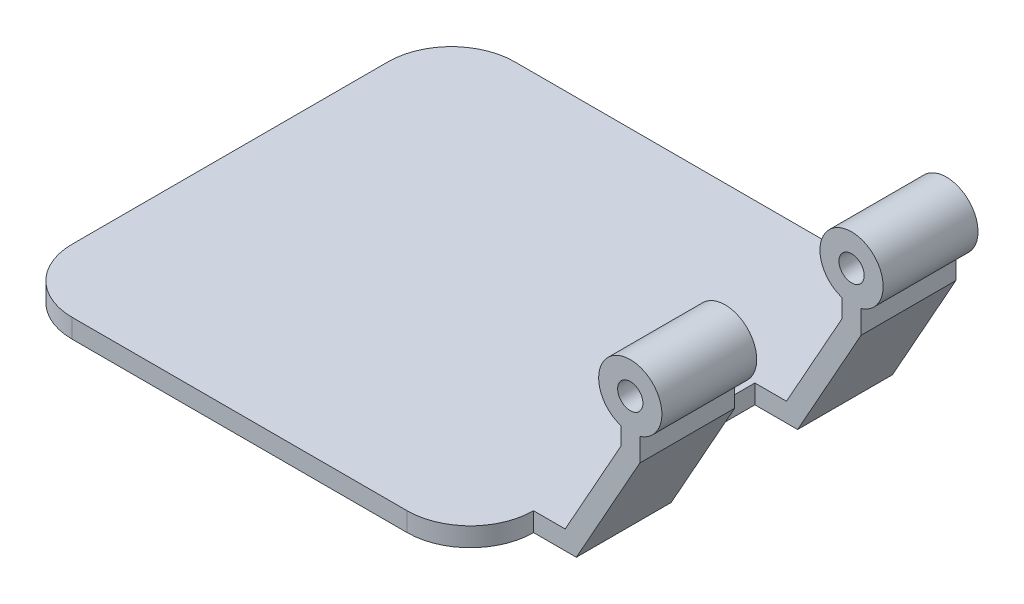
ISO-10303-21;
HEADER;
FILE_DESCRIPTION(('STEP AP214'),'2;1');
FILE_NAME('part.step','',(''),(''),'','','');
FILE_SCHEMA(('AUTOMOTIVE_DESIGN { 1 0 10303 214 1 1 1 1 }'));
ENDSEC;
DATA;
#1=APPLICATION_CONTEXT('core data for automotive mechanical design processes');
#2=APPLICATION_PROTOCOL_DEFINITION('international standard','automotive_design',2000,#1);
#3=PRODUCT_CONTEXT('',#1,'mechanical');
#4=PRODUCT('Part','Part','',(#3));
#5=PRODUCT_RELATED_PRODUCT_CATEGORY('part','',(#4));
#6=PRODUCT_DEFINITION_FORMATION('','',#4);
#7=PRODUCT_DEFINITION_CONTEXT('part definition',#1,'design');
#8=PRODUCT_DEFINITION('design','',#6,#7);
#9=PRODUCT_DEFINITION_SHAPE('','',#8);
#10=(LENGTH_UNIT() NAMED_UNIT(*) SI_UNIT(.MILLI.,.METRE.));
#11=(NAMED_UNIT(*) PLANE_ANGLE_UNIT() SI_UNIT($,.RADIAN.));
#12=(NAMED_UNIT(*) SI_UNIT($,.STERADIAN.) SOLID_ANGLE_UNIT());
#13=UNCERTAINTY_MEASURE_WITH_UNIT(LENGTH_MEASURE(1.E-05),#10,'distance_accuracy_value','');
#14=(GEOMETRIC_REPRESENTATION_CONTEXT(3) GLOBAL_UNCERTAINTY_ASSIGNED_CONTEXT((#13)) GLOBAL_UNIT_ASSIGNED_CONTEXT((#10,
#11,#12)) REPRESENTATION_CONTEXT('',''));
#15=CARTESIAN_POINT('',(0.,0.,0.));
#16=DIRECTION('',(0.,0.,1.));
#17=DIRECTION('',(1.,0.,0.));
#18=AXIS2_PLACEMENT_3D('',#15,#16,#17);
#19=CARTESIAN_POINT('',(90.2917408136151,26.3526404117387,50.));
#20=DIRECTION('',(0.,0.,-1.));
#21=DIRECTION('',(-1.,0.,0.));
#22=AXIS2_PLACEMENT_3D('',#19,#20,#21);
#23=CYLINDRICAL_SURFACE('',#22,5.);
#24=CARTESIAN_POINT('',(90.2917408136151,26.3526404117387,15.));
#25=DIRECTION('',(0.,0.,1.));
#26=DIRECTION('',(0.,-1.,0.));
#27=AXIS2_PLACEMENT_3D('',#24,#25,#26);
#28=CIRCLE('',#27,5.);
#29=CARTESIAN_POINT('',(91.7917408136151,21.582944404654,15.));
#30=VERTEX_POINT('',#29);
#31=CARTESIAN_POINT('',(88.7917408136151,21.582944404654,15.));
#32=VERTEX_POINT('',#31);
#33=EDGE_CURVE('E268',#30,#32,#28,.T.);
#34=ORIENTED_EDGE('',*,*,#33,.F.);
#35=DIRECTION('',(0.,0.,-1.));
#36=VECTOR('',#35,1.);
#37=CARTESIAN_POINT('',(91.7917408136151,21.582944404654,50.));
#38=LINE('',#37,#36);
#39=CARTESIAN_POINT('',(91.7917408136151,21.582944404654,0.));
#40=VERTEX_POINT('',#39);
#41=EDGE_CURVE('E355',#30,#40,#38,.T.);
#42=ORIENTED_EDGE('',*,*,#41,.T.);
#43=CARTESIAN_POINT('',(90.2917408136151,26.3526404117387,0.));
#44=DIRECTION('',(0.,0.,1.));
#45=DIRECTION('',(1.,0.,0.));
#46=AXIS2_PLACEMENT_3D('',#43,#44,#45);
#47=CIRCLE('',#46,5.);
#48=CARTESIAN_POINT('',(88.7917408136151,21.582944404654,0.));
#49=VERTEX_POINT('',#48);
#50=EDGE_CURVE('E296',#40,#49,#47,.T.);
#51=ORIENTED_EDGE('',*,*,#50,.T.);
#52=DIRECTION('',(0.,0.,-1.));
#53=VECTOR('',#52,1.);
#54=CARTESIAN_POINT('',(88.7917408136151,21.582944404654,50.));
#55=LINE('',#54,#53);
#56=EDGE_CURVE('E347',#32,#49,#55,.T.);
#57=ORIENTED_EDGE('',*,*,#56,.F.);
#58=EDGE_LOOP('',(#34,#42,#51,#57));
#59=FACE_BOUND('',#58,.T.);
#60=ADVANCED_FACE('F62',(#59),#23,.T.);
#61=CARTESIAN_POINT('',(90.2917408136151,26.3526404117387,35.));
#62=DIRECTION('',(0.,0.,-1.));
#63=DIRECTION('',(0.,1.,0.));
#64=AXIS2_PLACEMENT_3D('',#61,#62,#63);
#65=CIRCLE('',#64,5.);
#66=CARTESIAN_POINT('',(88.7917408136151,21.582944404654,35.));
#67=VERTEX_POINT('',#66);
#68=CARTESIAN_POINT('',(91.7917408136151,21.582944404654,35.));
#69=VERTEX_POINT('',#68);
#70=EDGE_CURVE('E282',#67,#69,#65,.T.);
#71=ORIENTED_EDGE('',*,*,#70,.F.);
#72=CARTESIAN_POINT('',(88.7917408136151,21.582944404654,50.));
#73=VERTEX_POINT('',#72);
#74=EDGE_CURVE('E352',#73,#67,#55,.T.);
#75=ORIENTED_EDGE('',*,*,#74,.F.);
#76=CARTESIAN_POINT('',(90.2917408136151,26.3526404117387,50.));
#77=DIRECTION('',(0.,0.,1.));
#78=DIRECTION('',(1.,0.,0.));
#79=AXIS2_PLACEMENT_3D('',#76,#77,#78);
#80=CIRCLE('',#79,5.);
#81=CARTESIAN_POINT('',(91.7917408136151,21.582944404654,50.));
#82=VERTEX_POINT('',#81);
#83=EDGE_CURVE('E319',#82,#73,#80,.T.);
#84=ORIENTED_EDGE('',*,*,#83,.F.);
#85=EDGE_CURVE('E356',#82,#69,#38,.T.);
#86=ORIENTED_EDGE('',*,*,#85,.T.);
#87=EDGE_LOOP('',(#71,#75,#84,#86));
#88=FACE_BOUND('',#87,.T.);
#89=ADVANCED_FACE('F463',(#88),#23,.T.);
#90=CARTESIAN_POINT('',(110.015744072677,30.0086373562634,35.));
#91=DIRECTION('',(0.,0.,-1.));
#92=DIRECTION('',(0.,1.,0.));
#93=AXIS2_PLACEMENT_3D('',#90,#91,#92);
#94=PLANE('',#93);
#95=DIRECTION('',(-0.488430045200838,-0.872603054627422,0.));
#96=VECTOR('',#95,1.);
#97=CARTESIAN_POINT('',(81.7587720513456,0.,35.));
#98=LINE('',#97,#96);
#99=CARTESIAN_POINT('',(91.7917408136151,17.9243666006214,35.));
#100=VERTEX_POINT('',#99);
#101=CARTESIAN_POINT('',(81.7587720513456,0.,35.));
#102=VERTEX_POINT('',#101);
#103=EDGE_CURVE('E231',#100,#102,#98,.T.);
#104=ORIENTED_EDGE('',*,*,#103,.T.);
#105=DIRECTION('',(1.,0.,0.));
#106=VECTOR('',#105,1.);
#107=CARTESIAN_POINT('',(75.,0.,35.));
#108=LINE('',#107,#106);
#109=CARTESIAN_POINT('',(75.,0.,35.));
#110=VERTEX_POINT('',#109);
#111=EDGE_CURVE('E227',#110,#102,#108,.T.);
#112=ORIENTED_EDGE('',*,*,#111,.F.);
#113=DIRECTION('',(0.,1.,0.));
#114=VECTOR('',#113,1.);
#115=CARTESIAN_POINT('',(75.,0.,35.));
#116=LINE('',#115,#114);
#117=CARTESIAN_POINT('',(75.,3.,35.));
#118=VERTEX_POINT('',#117);
#119=EDGE_CURVE('E212',#110,#118,#116,.T.);
#120=ORIENTED_EDGE('',*,*,#119,.T.);
#121=DIRECTION('',(1.,0.,0.));
#122=VECTOR('',#121,1.);
#123=CARTESIAN_POINT('',(75.,3.,35.));
#124=LINE('',#123,#122);
#125=CARTESIAN_POINT('',(80.,3.,35.));
#126=VERTEX_POINT('',#125);
#127=EDGE_CURVE('E240',#118,#126,#124,.T.);
#128=ORIENTED_EDGE('',*,*,#127,.T.);
#129=DIRECTION('',(0.488430045200838,0.872603054627422,0.));
#130=VECTOR('',#129,1.);
#131=CARTESIAN_POINT('',(88.7917408136151,18.7068549832936,35.));
#132=LINE('',#131,#130);
#133=CARTESIAN_POINT('',(88.7917408136151,18.7068549832936,35.));
#134=VERTEX_POINT('',#133);
#135=EDGE_CURVE('E285',#126,#134,#132,.T.);
#136=ORIENTED_EDGE('',*,*,#135,.T.);
#137=DIRECTION('',(0.,-1.,0.));
#138=VECTOR('',#137,1.);
#139=CARTESIAN_POINT('',(88.7917408136151,18.7068549832936,35.));
#140=LINE('',#139,#138);
#141=EDGE_CURVE('E286',#67,#134,#140,.T.);
#142=ORIENTED_EDGE('',*,*,#141,.F.);
#143=ORIENTED_EDGE('',*,*,#70,.T.);
#144=DIRECTION('',(0.,-1.,0.));
#145=VECTOR('',#144,1.);
#146=CARTESIAN_POINT('',(91.7917408136151,17.9243666006214,35.));
#147=LINE('',#146,#145);
#148=EDGE_CURVE('E284',#69,#100,#147,.T.);
#149=ORIENTED_EDGE('',*,*,#148,.T.);
#150=EDGE_LOOP('',(#104,#112,#120,#128,#136,#142,#143,#149));
#151=FACE_BOUND('',#150,.T.);
#152=CARTESIAN_POINT('',(90.2917408136151,26.3526404117387,35.));
#153=DIRECTION('',(0.,0.,-1.));
#154=DIRECTION('',(0.,1.,0.));
#155=AXIS2_PLACEMENT_3D('',#152,#153,#154);
#156=CIRCLE('',#155,2.);
#157=CARTESIAN_POINT('',(90.2917408136151,28.3526404117387,35.));
#158=VERTEX_POINT('',#157);
#159=EDGE_CURVE('E281',#158,#158,#156,.T.);
#160=ORIENTED_EDGE('',*,*,#159,.F.);
#161=EDGE_LOOP('',(#160));
#162=FACE_BOUND('',#161,.T.);
#163=ADVANCED_FACE('F228',(#151,#162),#94,.T.);
#164=CARTESIAN_POINT('',(110.015744072677,30.0086373562634,15.));
#165=DIRECTION('',(0.,0.,1.));
#166=DIRECTION('',(0.,-1.,0.));
#167=AXIS2_PLACEMENT_3D('',#164,#165,#166);
#168=PLANE('',#167);
#169=DIRECTION('',(-1.,0.,0.));
#170=VECTOR('',#169,1.);
#171=CARTESIAN_POINT('',(75.,0.,15.));
#172=LINE('',#171,#170);
#173=CARTESIAN_POINT('',(81.7587720513456,0.,15.));
#174=VERTEX_POINT('',#173);
#175=CARTESIAN_POINT('',(75.,0.,15.));
#176=VERTEX_POINT('',#175);
#177=EDGE_CURVE('E224',#174,#176,#172,.T.);
#178=ORIENTED_EDGE('',*,*,#177,.F.);
#179=DIRECTION('',(0.488430045200838,0.872603054627422,0.));
#180=VECTOR('',#179,1.);
#181=CARTESIAN_POINT('',(81.7587720513456,0.,15.));
#182=LINE('',#181,#180);
#183=CARTESIAN_POINT('',(91.7917408136151,17.9243666006214,15.));
#184=VERTEX_POINT('',#183);
#185=EDGE_CURVE('E271',#174,#184,#182,.T.);
#186=ORIENTED_EDGE('',*,*,#185,.T.);
#187=DIRECTION('',(0.,1.,0.));
#188=VECTOR('',#187,1.);
#189=CARTESIAN_POINT('',(91.7917408136151,17.9243666006214,15.));
#190=LINE('',#189,#188);
#191=EDGE_CURVE('E272',#184,#30,#190,.T.);
#192=ORIENTED_EDGE('',*,*,#191,.T.);
#193=ORIENTED_EDGE('',*,*,#33,.T.);
#194=DIRECTION('',(0.,1.,0.));
#195=VECTOR('',#194,1.);
#196=CARTESIAN_POINT('',(88.7917408136151,18.7068549832936,15.));
#197=LINE('',#196,#195);
#198=CARTESIAN_POINT('',(88.7917408136151,18.7068549832936,15.));
#199=VERTEX_POINT('',#198);
#200=EDGE_CURVE('E270',#199,#32,#197,.T.);
#201=ORIENTED_EDGE('',*,*,#200,.F.);
#202=DIRECTION('',(-0.488430045200838,-0.872603054627422,0.));
#203=VECTOR('',#202,1.);
#204=CARTESIAN_POINT('',(88.7917408136151,18.7068549832936,15.));
#205=LINE('',#204,#203);
#206=CARTESIAN_POINT('',(80.,3.,15.));
#207=VERTEX_POINT('',#206);
#208=EDGE_CURVE('E278',#199,#207,#205,.T.);
#209=ORIENTED_EDGE('',*,*,#208,.T.);
#210=DIRECTION('',(-1.,0.,0.));
#211=VECTOR('',#210,1.);
#212=CARTESIAN_POINT('',(75.,3.,15.));
#213=LINE('',#212,#211);
#214=CARTESIAN_POINT('',(75.,3.,15.));
#215=VERTEX_POINT('',#214);
#216=EDGE_CURVE('E238',#207,#215,#213,.T.);
#217=ORIENTED_EDGE('',*,*,#216,.T.);
#218=DIRECTION('',(0.,1.,0.));
#219=VECTOR('',#218,1.);
#220=CARTESIAN_POINT('',(75.,0.,15.));
#221=LINE('',#220,#219);
#222=EDGE_CURVE('E223',#176,#215,#221,.T.);
#223=ORIENTED_EDGE('',*,*,#222,.F.);
#224=EDGE_LOOP('',(#178,#186,#192,#193,#201,#209,#217,#223));
#225=FACE_BOUND('',#224,.T.);
#226=CARTESIAN_POINT('',(90.2917408136151,26.3526404117387,15.));
#227=DIRECTION('',(0.,0.,1.));
#228=DIRECTION('',(0.,-1.,0.));
#229=AXIS2_PLACEMENT_3D('',#226,#227,#228);
#230=CIRCLE('',#229,2.);
#231=CARTESIAN_POINT('',(90.2917408136151,24.3526404117387,15.));
#232=VERTEX_POINT('',#231);
#233=EDGE_CURVE('E267',#232,#232,#230,.T.);
#234=ORIENTED_EDGE('',*,*,#233,.F.);
#235=EDGE_LOOP('',(#234));
#236=FACE_BOUND('',#235,.T.);
#237=ADVANCED_FACE('F431',(#225,#236),#168,.T.);
#238=CARTESIAN_POINT('',(88.7917408136151,18.7068549832936,50.));
#239=DIRECTION('',(-1.,0.,0.));
#240=DIRECTION('',(0.,0.,1.));
#241=AXIS2_PLACEMENT_3D('',#238,#239,#240);
#242=PLANE('',#241);
#243=ORIENTED_EDGE('',*,*,#74,.T.);
#244=ORIENTED_EDGE('',*,*,#141,.T.);
#245=DIRECTION('',(0.,0.,-1.));
#246=VECTOR('',#245,1.);
#247=CARTESIAN_POINT('',(88.7917408136151,18.7068549832936,50.));
#248=LINE('',#247,#246);
#249=CARTESIAN_POINT('',(88.7917408136151,18.7068549832936,50.));
#250=VERTEX_POINT('',#249);
#251=EDGE_CURVE('E337',#250,#134,#248,.T.);
#252=ORIENTED_EDGE('',*,*,#251,.F.);
#253=DIRECTION('',(0.,1.,0.));
#254=VECTOR('',#253,1.);
#255=CARTESIAN_POINT('',(88.7917408136151,18.7068549832936,50.));
#256=LINE('',#255,#254);
#257=EDGE_CURVE('E307',#250,#73,#256,.T.);
#258=ORIENTED_EDGE('',*,*,#257,.T.);
#259=EDGE_LOOP('',(#243,#244,#252,#258));
#260=FACE_BOUND('',#259,.T.);
#261=ADVANCED_FACE('F455',(#260),#242,.T.);
#262=CARTESIAN_POINT('',(88.7917408136151,18.7068549832936,0.));
#263=VERTEX_POINT('',#262);
#264=EDGE_CURVE('E336',#199,#263,#248,.T.);
#265=ORIENTED_EDGE('',*,*,#264,.F.);
#266=ORIENTED_EDGE('',*,*,#200,.T.);
#267=ORIENTED_EDGE('',*,*,#56,.T.);
#268=DIRECTION('',(0.,1.,0.));
#269=VECTOR('',#268,1.);
#270=CARTESIAN_POINT('',(88.7917408136151,18.7068549832936,0.));
#271=LINE('',#270,#269);
#272=EDGE_CURVE('E325',#263,#49,#271,.T.);
#273=ORIENTED_EDGE('',*,*,#272,.F.);
#274=EDGE_LOOP('',(#265,#266,#267,#273));
#275=FACE_BOUND('',#274,.T.);
#276=ADVANCED_FACE('F442',(#275),#242,.T.);
#277=CARTESIAN_POINT('',(88.7917408136151,18.7068549832936,50.));
#278=DIRECTION('',(0.872603054627422,-0.488430045200838,0.));
#279=DIRECTION('',(0.488430045200838,0.872603054627422,0.));
#280=AXIS2_PLACEMENT_3D('',#277,#278,#279);
#281=PLANE('',#280);
#282=ORIENTED_EDGE('',*,*,#135,.F.);
#283=DIRECTION('',(0.,0.,-1.));
#284=VECTOR('',#283,1.);
#285=CARTESIAN_POINT('',(80.,3.,50.));
#286=LINE('',#285,#284);
#287=CARTESIAN_POINT('',(80.,3.,50.));
#288=VERTEX_POINT('',#287);
#289=EDGE_CURVE('E333',#288,#126,#286,.T.);
#290=ORIENTED_EDGE('',*,*,#289,.F.);
#291=DIRECTION('',(-0.488430045200838,-0.872603054627422,0.));
#292=VECTOR('',#291,1.);
#293=CARTESIAN_POINT('',(88.7917408136151,18.7068549832936,50.));
#294=LINE('',#293,#292);
#295=EDGE_CURVE('E310',#250,#288,#294,.T.);
#296=ORIENTED_EDGE('',*,*,#295,.F.);
#297=ORIENTED_EDGE('',*,*,#251,.T.);
#298=EDGE_LOOP('',(#282,#290,#296,#297));
#299=FACE_BOUND('',#298,.T.);
#300=ADVANCED_FACE('F451',(#299),#281,.F.);
#301=ORIENTED_EDGE('',*,*,#208,.F.);
#302=ORIENTED_EDGE('',*,*,#264,.T.);
#303=DIRECTION('',(-0.488430045200838,-0.872603054627422,0.));
#304=VECTOR('',#303,1.);
#305=CARTESIAN_POINT('',(88.7917408136151,18.7068549832936,0.));
#306=LINE('',#305,#304);
#307=CARTESIAN_POINT('',(80.,3.,0.));
#308=VERTEX_POINT('',#307);
#309=EDGE_CURVE('E328',#263,#308,#306,.T.);
#310=ORIENTED_EDGE('',*,*,#309,.T.);
#311=EDGE_CURVE('E315',#207,#308,#286,.T.);
#312=ORIENTED_EDGE('',*,*,#311,.F.);
#313=EDGE_LOOP('',(#301,#302,#310,#312));
#314=FACE_BOUND('',#313,.T.);
#315=ADVANCED_FACE('F446',(#314),#281,.F.);
#316=CARTESIAN_POINT('',(80.,3.,50.));
#317=DIRECTION('',(0.,-1.,0.));
#318=DIRECTION('',(1.,0.,0.));
#319=AXIS2_PLACEMENT_3D('',#316,#317,#318);
#320=PLANE('',#319);
#321=DIRECTION('',(-1.,0.,0.));
#322=VECTOR('',#321,1.);
#323=CARTESIAN_POINT('',(80.,3.,0.));
#324=LINE('',#323,#322);
#325=CARTESIAN_POINT('',(75.,3.,0.));
#326=VERTEX_POINT('',#325);
#327=EDGE_CURVE('E302',#308,#326,#324,.T.);
#328=ORIENTED_EDGE('',*,*,#327,.T.);
#329=CARTESIAN_POINT('',(65.,3.,0.));
#330=DIRECTION('',(0.,-1.,0.));
#331=DIRECTION('',(1.,0.,0.));
#332=AXIS2_PLACEMENT_3D('',#329,#330,#331);
#333=CIRCLE('',#332,10.);
#334=CARTESIAN_POINT('',(65.,3.,-10.));
#335=VERTEX_POINT('',#334);
#336=EDGE_CURVE('E372',#326,#335,#333,.F.);
#337=ORIENTED_EDGE('',*,*,#336,.T.);
#338=DIRECTION('',(-1.,0.,0.));
#339=VECTOR('',#338,1.);
#340=CARTESIAN_POINT('',(2.,2.99999999999999,-10.));
#341=LINE('',#340,#339);
#342=CARTESIAN_POINT('',(12.,2.99999999999999,-10.));
#343=VERTEX_POINT('',#342);
#344=EDGE_CURVE('E251',#335,#343,#341,.T.);
#345=ORIENTED_EDGE('',*,*,#344,.T.);
#346=CARTESIAN_POINT('',(12.,2.99999999999999,0.));
#347=DIRECTION('',(0.,-1.,0.));
#348=DIRECTION('',(1.,0.,0.));
#349=AXIS2_PLACEMENT_3D('',#346,#347,#348);
#350=CIRCLE('',#349,10.);
#351=CARTESIAN_POINT('',(2.,2.99999999999999,0.));
#352=VERTEX_POINT('',#351);
#353=EDGE_CURVE('E370',#343,#352,#350,.F.);
#354=ORIENTED_EDGE('',*,*,#353,.T.);
#355=DIRECTION('',(0.,0.,1.));
#356=VECTOR('',#355,1.);
#357=CARTESIAN_POINT('',(2.,2.99999999999999,-10.));
#358=LINE('',#357,#356);
#359=CARTESIAN_POINT('',(2.00000000000001,2.99999999999999,50.));
#360=VERTEX_POINT('',#359);
#361=EDGE_CURVE('E246',#352,#360,#358,.T.);
#362=ORIENTED_EDGE('',*,*,#361,.T.);
#363=CARTESIAN_POINT('',(12.,2.99999999999999,50.));
#364=DIRECTION('',(0.,-1.,0.));
#365=DIRECTION('',(1.,0.,0.));
#366=AXIS2_PLACEMENT_3D('',#363,#364,#365);
#367=CIRCLE('',#366,10.);
#368=CARTESIAN_POINT('',(12.,2.99999999999999,60.));
#369=VERTEX_POINT('',#368);
#370=EDGE_CURVE('E368',#360,#369,#367,.F.);
#371=ORIENTED_EDGE('',*,*,#370,.T.);
#372=DIRECTION('',(1.,0.,0.));
#373=VECTOR('',#372,1.);
#374=CARTESIAN_POINT('',(2.,2.99999999999999,60.));
#375=LINE('',#374,#373);
#376=CARTESIAN_POINT('',(65.,3.,60.));
#377=VERTEX_POINT('',#376);
#378=EDGE_CURVE('E260',#369,#377,#375,.T.);
#379=ORIENTED_EDGE('',*,*,#378,.T.);
#380=CARTESIAN_POINT('',(65.,3.,50.));
#381=DIRECTION('',(0.,-1.,0.));
#382=DIRECTION('',(1.,0.,0.));
#383=AXIS2_PLACEMENT_3D('',#380,#381,#382);
#384=CIRCLE('',#383,10.);
#385=CARTESIAN_POINT('',(75.,3.,50.));
#386=VERTEX_POINT('',#385);
#387=EDGE_CURVE('E366',#377,#386,#384,.F.);
#388=ORIENTED_EDGE('',*,*,#387,.T.);
#389=DIRECTION('',(-1.,0.,0.));
#390=VECTOR('',#389,1.);
#391=CARTESIAN_POINT('',(80.,3.,50.));
#392=LINE('',#391,#390);
#393=EDGE_CURVE('E312',#288,#386,#392,.T.);
#394=ORIENTED_EDGE('',*,*,#393,.F.);
#395=ORIENTED_EDGE('',*,*,#289,.T.);
#396=ORIENTED_EDGE('',*,*,#127,.F.);
#397=DIRECTION('',(0.,0.,1.));
#398=VECTOR('',#397,1.);
#399=CARTESIAN_POINT('',(75.,3.,15.));
#400=LINE('',#399,#398);
#401=EDGE_CURVE('E220',#215,#118,#400,.T.);
#402=ORIENTED_EDGE('',*,*,#401,.F.);
#403=ORIENTED_EDGE('',*,*,#216,.F.);
#404=ORIENTED_EDGE('',*,*,#311,.T.);
#405=EDGE_LOOP('',(#328,#337,#345,#354,#362,#371,#379,#388,#394,#395,#396,#402,#403,#404));
#406=FACE_BOUND('',#405,.T.);
#407=ADVANCED_FACE('F398',(#406),#320,.F.);
#408=CARTESIAN_POINT('',(81.7587720513456,0.,50.));
#409=DIRECTION('',(-0.872603054627422,0.488430045200838,0.));
#410=DIRECTION('',(-0.488430045200838,-0.872603054627422,0.));
#411=AXIS2_PLACEMENT_3D('',#408,#409,#410);
#412=PLANE('',#411);
#413=ORIENTED_EDGE('',*,*,#103,.F.);
#414=DIRECTION('',(0.,0.,-1.));
#415=VECTOR('',#414,1.);
#416=CARTESIAN_POINT('',(91.7917408136151,17.9243666006214,50.));
#417=LINE('',#416,#415);
#418=CARTESIAN_POINT('',(91.7917408136151,17.9243666006214,50.));
#419=VERTEX_POINT('',#418);
#420=EDGE_CURVE('E341',#419,#100,#417,.T.);
#421=ORIENTED_EDGE('',*,*,#420,.F.);
#422=DIRECTION('',(0.488430045200838,0.872603054627422,0.));
#423=VECTOR('',#422,1.);
#424=CARTESIAN_POINT('',(81.7587720513456,0.,50.));
#425=LINE('',#424,#423);
#426=CARTESIAN_POINT('',(81.7587720513456,0.,50.));
#427=VERTEX_POINT('',#426);
#428=EDGE_CURVE('E301',#427,#419,#425,.T.);
#429=ORIENTED_EDGE('',*,*,#428,.F.);
#430=DIRECTION('',(0.,0.,-1.));
#431=VECTOR('',#430,1.);
#432=CARTESIAN_POINT('',(81.7587720513456,0.,50.));
#433=LINE('',#432,#431);
#434=EDGE_CURVE('E345',#427,#102,#433,.T.);
#435=ORIENTED_EDGE('',*,*,#434,.T.);
#436=EDGE_LOOP('',(#413,#421,#429,#435));
#437=FACE_BOUND('',#436,.T.);
#438=ADVANCED_FACE('F470',(#437),#412,.F.);
#439=ORIENTED_EDGE('',*,*,#185,.F.);
#440=CARTESIAN_POINT('',(81.7587720513456,0.,0.));
#441=VERTEX_POINT('',#440);
#442=EDGE_CURVE('E344',#174,#441,#433,.T.);
#443=ORIENTED_EDGE('',*,*,#442,.T.);
#444=DIRECTION('',(0.488430045200838,0.872603054627422,0.));
#445=VECTOR('',#444,1.);
#446=CARTESIAN_POINT('',(81.7587720513456,0.,0.));
#447=LINE('',#446,#445);
#448=CARTESIAN_POINT('',(91.7917408136151,17.9243666006214,0.));
#449=VERTEX_POINT('',#448);
#450=EDGE_CURVE('E318',#441,#449,#447,.T.);
#451=ORIENTED_EDGE('',*,*,#450,.T.);
#452=EDGE_CURVE('E340',#184,#449,#417,.T.);
#453=ORIENTED_EDGE('',*,*,#452,.F.);
#454=EDGE_LOOP('',(#439,#443,#451,#453));
#455=FACE_BOUND('',#454,.T.);
#456=ADVANCED_FACE('F427',(#455),#412,.F.);
#457=CARTESIAN_POINT('',(91.7917408136151,17.9243666006214,50.));
#458=DIRECTION('',(-1.,0.,0.));
#459=DIRECTION('',(0.,0.,1.));
#460=AXIS2_PLACEMENT_3D('',#457,#458,#459);
#461=PLANE('',#460);
#462=ORIENTED_EDGE('',*,*,#148,.F.);
#463=ORIENTED_EDGE('',*,*,#85,.F.);
#464=DIRECTION('',(0.,1.,0.));
#465=VECTOR('',#464,1.);
#466=CARTESIAN_POINT('',(91.7917408136151,17.9243666006214,50.));
#467=LINE('',#466,#465);
#468=EDGE_CURVE('E304',#419,#82,#467,.T.);
#469=ORIENTED_EDGE('',*,*,#468,.F.);
#470=ORIENTED_EDGE('',*,*,#420,.T.);
#471=EDGE_LOOP('',(#462,#463,#469,#470));
#472=FACE_BOUND('',#471,.T.);
#473=ADVANCED_FACE('F459',(#472),#461,.F.);
#474=ORIENTED_EDGE('',*,*,#191,.F.);
#475=ORIENTED_EDGE('',*,*,#452,.T.);
#476=DIRECTION('',(0.,1.,0.));
#477=VECTOR('',#476,1.);
#478=CARTESIAN_POINT('',(91.7917408136151,17.9243666006214,0.));
#479=LINE('',#478,#477);
#480=EDGE_CURVE('E322',#449,#40,#479,.T.);
#481=ORIENTED_EDGE('',*,*,#480,.T.);
#482=ORIENTED_EDGE('',*,*,#41,.F.);
#483=EDGE_LOOP('',(#474,#475,#481,#482));
#484=FACE_BOUND('',#483,.T.);
#485=ADVANCED_FACE('F435',(#484),#461,.F.);
#486=CARTESIAN_POINT('',(90.2917408136151,26.3526404117387,50.));
#487=DIRECTION('',(0.,0.,-1.));
#488=DIRECTION('',(-1.,0.,0.));
#489=AXIS2_PLACEMENT_3D('',#486,#487,#488);
#490=CYLINDRICAL_SURFACE('',#489,2.);
#491=CARTESIAN_POINT('',(90.2917408136151,26.3526404117387,50.));
#492=DIRECTION('',(0.,0.,1.));
#493=DIRECTION('',(1.,0.,0.));
#494=AXIS2_PLACEMENT_3D('',#491,#492,#493);
#495=CIRCLE('',#494,2.);
#496=CARTESIAN_POINT('',(92.2917408136151,26.3526404117387,50.));
#497=VERTEX_POINT('',#496);
#498=EDGE_CURVE('E293',#497,#497,#495,.T.);
#499=ORIENTED_EDGE('',*,*,#498,.T.);
#500=EDGE_LOOP('',(#499));
#501=FACE_BOUND('',#500,.T.);
#502=ORIENTED_EDGE('',*,*,#159,.T.);
#503=EDGE_LOOP('',(#502));
#504=FACE_BOUND('',#503,.T.);
#505=ADVANCED_FACE('F620',(#501,#504),#490,.F.);
#506=CARTESIAN_POINT('',(90.2917408136151,26.3526404117387,0.));
#507=DIRECTION('',(0.,0.,1.));
#508=DIRECTION('',(1.,0.,0.));
#509=AXIS2_PLACEMENT_3D('',#506,#507,#508);
#510=CIRCLE('',#509,2.);
#511=CARTESIAN_POINT('',(92.2917408136151,26.3526404117387,0.));
#512=VERTEX_POINT('',#511);
#513=EDGE_CURVE('E292',#512,#512,#510,.T.);
#514=ORIENTED_EDGE('',*,*,#513,.F.);
#515=EDGE_LOOP('',(#514));
#516=FACE_BOUND('',#515,.T.);
#517=ORIENTED_EDGE('',*,*,#233,.T.);
#518=EDGE_LOOP('',(#517));
#519=FACE_BOUND('',#518,.T.);
#520=ADVANCED_FACE('F569',(#516,#519),#490,.F.);
#521=CARTESIAN_POINT('',(0.,0.,50.));
#522=DIRECTION('',(0.,1.,0.));
#523=DIRECTION('',(0.,0.,1.));
#524=AXIS2_PLACEMENT_3D('',#521,#522,#523);
#525=PLANE('',#524);
#526=DIRECTION('',(-1.,0.,0.));
#527=VECTOR('',#526,1.);
#528=CARTESIAN_POINT('',(2.,0.,-10.));
#529=LINE('',#528,#527);
#530=CARTESIAN_POINT('',(65.,0.,-10.));
#531=VERTEX_POINT('',#530);
#532=CARTESIAN_POINT('',(12.,0.,-10.));
#533=VERTEX_POINT('',#532);
#534=EDGE_CURVE('E254',#531,#533,#529,.T.);
#535=ORIENTED_EDGE('',*,*,#534,.F.);
#536=CARTESIAN_POINT('',(65.,0.,0.));
#537=DIRECTION('',(0.,1.,0.));
#538=DIRECTION('',(0.,0.,1.));
#539=AXIS2_PLACEMENT_3D('',#536,#537,#538);
#540=CIRCLE('',#539,10.);
#541=CARTESIAN_POINT('',(75.,0.,0.));
#542=VERTEX_POINT('',#541);
#543=EDGE_CURVE('E384',#531,#542,#540,.F.);
#544=ORIENTED_EDGE('',*,*,#543,.T.);
#545=DIRECTION('',(1.,0.,0.));
#546=VECTOR('',#545,1.);
#547=CARTESIAN_POINT('',(0.,0.,0.));
#548=LINE('',#547,#546);
#549=EDGE_CURVE('E316',#542,#441,#548,.T.);
#550=ORIENTED_EDGE('',*,*,#549,.T.);
#551=ORIENTED_EDGE('',*,*,#442,.F.);
#552=ORIENTED_EDGE('',*,*,#177,.T.);
#553=DIRECTION('',(0.,0.,1.));
#554=VECTOR('',#553,1.);
#555=CARTESIAN_POINT('',(75.,0.,15.));
#556=LINE('',#555,#554);
#557=EDGE_CURVE('E217',#176,#110,#556,.T.);
#558=ORIENTED_EDGE('',*,*,#557,.T.);
#559=ORIENTED_EDGE('',*,*,#111,.T.);
#560=ORIENTED_EDGE('',*,*,#434,.F.);
#561=DIRECTION('',(1.,0.,0.));
#562=VECTOR('',#561,1.);
#563=CARTESIAN_POINT('',(0.,0.,50.));
#564=LINE('',#563,#562);
#565=CARTESIAN_POINT('',(75.,0.,50.));
#566=VERTEX_POINT('',#565);
#567=EDGE_CURVE('E299',#566,#427,#564,.T.);
#568=ORIENTED_EDGE('',*,*,#567,.F.);
#569=CARTESIAN_POINT('',(65.,0.,50.));
#570=DIRECTION('',(0.,1.,0.));
#571=DIRECTION('',(0.,0.,1.));
#572=AXIS2_PLACEMENT_3D('',#569,#570,#571);
#573=CIRCLE('',#572,10.);
#574=CARTESIAN_POINT('',(65.,0.,60.));
#575=VERTEX_POINT('',#574);
#576=EDGE_CURVE('E379',#566,#575,#573,.F.);
#577=ORIENTED_EDGE('',*,*,#576,.T.);
#578=DIRECTION('',(1.,0.,0.));
#579=VECTOR('',#578,1.);
#580=CARTESIAN_POINT('',(2.,0.,60.));
#581=LINE('',#580,#579);
#582=CARTESIAN_POINT('',(12.,0.,60.));
#583=VERTEX_POINT('',#582);
#584=EDGE_CURVE('E250',#583,#575,#581,.T.);
#585=ORIENTED_EDGE('',*,*,#584,.F.);
#586=CARTESIAN_POINT('',(12.,0.,50.));
#587=DIRECTION('',(0.,1.,0.));
#588=DIRECTION('',(0.,0.,1.));
#589=AXIS2_PLACEMENT_3D('',#586,#587,#588);
#590=CIRCLE('',#589,10.);
#591=CARTESIAN_POINT('',(2.00000000000001,0.,50.));
#592=VERTEX_POINT('',#591);
#593=EDGE_CURVE('E77',#583,#592,#590,.F.);
#594=ORIENTED_EDGE('',*,*,#593,.T.);
#595=DIRECTION('',(0.,0.,1.));
#596=VECTOR('',#595,1.);
#597=CARTESIAN_POINT('',(2.,0.,-10.));
#598=LINE('',#597,#596);
#599=CARTESIAN_POINT('',(2.,0.,0.));
#600=VERTEX_POINT('',#599);
#601=EDGE_CURVE('E248',#600,#592,#598,.T.);
#602=ORIENTED_EDGE('',*,*,#601,.F.);
#603=CARTESIAN_POINT('',(12.,0.,0.));
#604=DIRECTION('',(0.,1.,0.));
#605=DIRECTION('',(0.,0.,1.));
#606=AXIS2_PLACEMENT_3D('',#603,#604,#605);
#607=CIRCLE('',#606,10.);
#608=EDGE_CURVE('E382',#600,#533,#607,.F.);
#609=ORIENTED_EDGE('',*,*,#608,.T.);
#610=EDGE_LOOP('',(#535,#544,#550,#551,#552,#558,#559,#560,#568,#577,#585,#594,#602,#609));
#611=FACE_BOUND('',#610,.T.);
#612=ADVANCED_FACE('F236',(#611),#525,.F.);
#613=CARTESIAN_POINT('',(0.,0.,0.));
#614=DIRECTION('',(0.,0.,1.));
#615=DIRECTION('',(1.,0.,0.));
#616=AXIS2_PLACEMENT_3D('',#613,#614,#615);
#617=PLANE('',#616);
#618=ORIENTED_EDGE('',*,*,#549,.F.);
#619=DIRECTION('',(0.,1.,0.));
#620=VECTOR('',#619,1.);
#621=CARTESIAN_POINT('',(75.,0.,0.));
#622=LINE('',#621,#620);
#623=EDGE_CURVE('E257',#542,#326,#622,.T.);
#624=ORIENTED_EDGE('',*,*,#623,.T.);
#625=ORIENTED_EDGE('',*,*,#327,.F.);
#626=ORIENTED_EDGE('',*,*,#309,.F.);
#627=ORIENTED_EDGE('',*,*,#272,.T.);
#628=ORIENTED_EDGE('',*,*,#50,.F.);
#629=ORIENTED_EDGE('',*,*,#480,.F.);
#630=ORIENTED_EDGE('',*,*,#450,.F.);
#631=EDGE_LOOP('',(#618,#624,#625,#626,#627,#628,#629,#630));
#632=FACE_BOUND('',#631,.T.);
#633=ORIENTED_EDGE('',*,*,#513,.T.);
#634=EDGE_LOOP('',(#633));
#635=FACE_BOUND('',#634,.T.);
#636=ADVANCED_FACE('F419',(#632,#635),#617,.F.);
#637=CARTESIAN_POINT('',(0.,0.,50.));
#638=DIRECTION('',(0.,0.,1.));
#639=DIRECTION('',(1.,0.,0.));
#640=AXIS2_PLACEMENT_3D('',#637,#638,#639);
#641=PLANE('',#640);
#642=DIRECTION('',(0.,1.,0.));
#643=VECTOR('',#642,1.);
#644=CARTESIAN_POINT('',(75.,0.,50.));
#645=LINE('',#644,#643);
#646=EDGE_CURVE('E359',#566,#386,#645,.T.);
#647=ORIENTED_EDGE('',*,*,#646,.F.);
#648=ORIENTED_EDGE('',*,*,#567,.T.);
#649=ORIENTED_EDGE('',*,*,#428,.T.);
#650=ORIENTED_EDGE('',*,*,#468,.T.);
#651=ORIENTED_EDGE('',*,*,#83,.T.);
#652=ORIENTED_EDGE('',*,*,#257,.F.);
#653=ORIENTED_EDGE('',*,*,#295,.T.);
#654=ORIENTED_EDGE('',*,*,#393,.T.);
#655=EDGE_LOOP('',(#647,#648,#649,#650,#651,#652,#653,#654));
#656=FACE_BOUND('',#655,.T.);
#657=ORIENTED_EDGE('',*,*,#498,.F.);
#658=EDGE_LOOP('',(#657));
#659=FACE_BOUND('',#658,.T.);
#660=ADVANCED_FACE('F465',(#656,#659),#641,.T.);
#661=CARTESIAN_POINT('',(2.,0.,-10.));
#662=DIRECTION('',(-1.,0.,0.));
#663=DIRECTION('',(0.,0.,1.));
#664=AXIS2_PLACEMENT_3D('',#661,#662,#663);
#665=PLANE('',#664);
#666=ORIENTED_EDGE('',*,*,#361,.F.);
#667=DIRECTION('',(0.,1.,0.));
#668=VECTOR('',#667,1.);
#669=CARTESIAN_POINT('',(2.,0.,0.));
#670=LINE('',#669,#668);
#671=EDGE_CURVE('E84',#352,#600,#670,.F.);
#672=ORIENTED_EDGE('',*,*,#671,.T.);
#673=ORIENTED_EDGE('',*,*,#601,.T.);
#674=DIRECTION('',(0.,1.,0.));
#675=VECTOR('',#674,1.);
#676=CARTESIAN_POINT('',(2.00000000000001,0.,50.));
#677=LINE('',#676,#675);
#678=EDGE_CURVE('E386',#592,#360,#677,.T.);
#679=ORIENTED_EDGE('',*,*,#678,.T.);
#680=EDGE_LOOP('',(#666,#672,#673,#679));
#681=FACE_BOUND('',#680,.T.);
#682=ADVANCED_FACE('F403',(#681),#665,.T.);
#683=CARTESIAN_POINT('',(2.,0.,-10.));
#684=DIRECTION('',(0.,0.,-1.));
#685=DIRECTION('',(-1.,0.,0.));
#686=AXIS2_PLACEMENT_3D('',#683,#684,#685);
#687=PLANE('',#686);
#688=ORIENTED_EDGE('',*,*,#344,.F.);
#689=DIRECTION('',(0.,1.,0.));
#690=VECTOR('',#689,1.);
#691=CARTESIAN_POINT('',(65.,0.,-10.));
#692=LINE('',#691,#690);
#693=EDGE_CURVE('E377',#335,#531,#692,.F.);
#694=ORIENTED_EDGE('',*,*,#693,.T.);
#695=ORIENTED_EDGE('',*,*,#534,.T.);
#696=DIRECTION('',(0.,1.,0.));
#697=VECTOR('',#696,1.);
#698=CARTESIAN_POINT('',(12.,0.,-10.));
#699=LINE('',#698,#697);
#700=EDGE_CURVE('E374',#533,#343,#699,.T.);
#701=ORIENTED_EDGE('',*,*,#700,.T.);
#702=EDGE_LOOP('',(#688,#694,#695,#701));
#703=FACE_BOUND('',#702,.T.);
#704=ADVANCED_FACE('F410',(#703),#687,.T.);
#705=CARTESIAN_POINT('',(2.,0.,60.));
#706=DIRECTION('',(0.,0.,1.));
#707=DIRECTION('',(1.,0.,0.));
#708=AXIS2_PLACEMENT_3D('',#705,#706,#707);
#709=PLANE('',#708);
#710=ORIENTED_EDGE('',*,*,#378,.F.);
#711=DIRECTION('',(0.,1.,0.));
#712=VECTOR('',#711,1.);
#713=CARTESIAN_POINT('',(12.,0.,60.));
#714=LINE('',#713,#712);
#715=EDGE_CURVE('E12',#369,#583,#714,.F.);
#716=ORIENTED_EDGE('',*,*,#715,.T.);
#717=ORIENTED_EDGE('',*,*,#584,.T.);
#718=DIRECTION('',(0.,1.,0.));
#719=VECTOR('',#718,1.);
#720=CARTESIAN_POINT('',(65.,0.,60.));
#721=LINE('',#720,#719);
#722=EDGE_CURVE('E70',#575,#377,#721,.T.);
#723=ORIENTED_EDGE('',*,*,#722,.T.);
#724=EDGE_LOOP('',(#710,#716,#717,#723));
#725=FACE_BOUND('',#724,.T.);
#726=ADVANCED_FACE('F393',(#725),#709,.T.);
#727=CARTESIAN_POINT('',(75.,0.,15.));
#728=DIRECTION('',(-1.,0.,0.));
#729=DIRECTION('',(0.,-1.,0.));
#730=AXIS2_PLACEMENT_3D('',#727,#728,#729);
#731=PLANE('',#730);
#732=ORIENTED_EDGE('',*,*,#401,.T.);
#733=ORIENTED_EDGE('',*,*,#119,.F.);
#734=ORIENTED_EDGE('',*,*,#557,.F.);
#735=ORIENTED_EDGE('',*,*,#222,.T.);
#736=EDGE_LOOP('',(#732,#733,#734,#735));
#737=FACE_BOUND('',#736,.T.);
#738=ADVANCED_FACE('F214',(#737),#731,.F.);
#739=CARTESIAN_POINT('',(65.,0.,0.));
#740=DIRECTION('',(0.,1.,0.));
#741=DIRECTION('',(-1.,0.,0.));
#742=AXIS2_PLACEMENT_3D('',#739,#740,#741);
#743=CYLINDRICAL_SURFACE('',#742,10.);
#744=ORIENTED_EDGE('',*,*,#543,.F.);
#745=ORIENTED_EDGE('',*,*,#693,.F.);
#746=ORIENTED_EDGE('',*,*,#336,.F.);
#747=ORIENTED_EDGE('',*,*,#623,.F.);
#748=EDGE_LOOP('',(#744,#745,#746,#747));
#749=FACE_BOUND('',#748,.T.);
#750=ADVANCED_FACE('F416',(#749),#743,.T.);
#751=CARTESIAN_POINT('',(12.,0.,0.));
#752=DIRECTION('',(0.,1.,0.));
#753=DIRECTION('',(-1.,0.,0.));
#754=AXIS2_PLACEMENT_3D('',#751,#752,#753);
#755=CYLINDRICAL_SURFACE('',#754,10.);
#756=ORIENTED_EDGE('',*,*,#608,.F.);
#757=ORIENTED_EDGE('',*,*,#671,.F.);
#758=ORIENTED_EDGE('',*,*,#353,.F.);
#759=ORIENTED_EDGE('',*,*,#700,.F.);
#760=EDGE_LOOP('',(#756,#757,#758,#759));
#761=FACE_BOUND('',#760,.T.);
#762=ADVANCED_FACE('F407',(#761),#755,.T.);
#763=CARTESIAN_POINT('',(12.,0.,50.));
#764=DIRECTION('',(0.,1.,0.));
#765=DIRECTION('',(-1.,0.,0.));
#766=AXIS2_PLACEMENT_3D('',#763,#764,#765);
#767=CYLINDRICAL_SURFACE('',#766,10.);
#768=ORIENTED_EDGE('',*,*,#593,.F.);
#769=ORIENTED_EDGE('',*,*,#715,.F.);
#770=ORIENTED_EDGE('',*,*,#370,.F.);
#771=ORIENTED_EDGE('',*,*,#678,.F.);
#772=EDGE_LOOP('',(#768,#769,#770,#771));
#773=FACE_BOUND('',#772,.T.);
#774=ADVANCED_FACE('F402',(#773),#767,.T.);
#775=CARTESIAN_POINT('',(65.,0.,50.));
#776=DIRECTION('',(0.,1.,0.));
#777=DIRECTION('',(-1.,0.,0.));
#778=AXIS2_PLACEMENT_3D('',#775,#776,#777);
#779=CYLINDRICAL_SURFACE('',#778,10.);
#780=ORIENTED_EDGE('',*,*,#576,.F.);
#781=ORIENTED_EDGE('',*,*,#646,.T.);
#782=ORIENTED_EDGE('',*,*,#387,.F.);
#783=ORIENTED_EDGE('',*,*,#722,.F.);
#784=EDGE_LOOP('',(#780,#781,#782,#783));
#785=FACE_BOUND('',#784,.T.);
#786=ADVANCED_FACE('F64',(#785),#779,.T.);
#787=CLOSED_SHELL('',(#60,#89,#163,#237,#261,#276,#300,#315,#407,#438,#456,#473,#485,#505,#520,
#612,#636,#660,#682,#704,#726,#738,#750,#762,#774,#786));
#788=MANIFOLD_SOLID_BREP('B2',#787);
#789=ADVANCED_BREP_SHAPE_REPRESENTATION('',(#18,#788),#14);
#790=SHAPE_DEFINITION_REPRESENTATION(#9,#789);
ENDSEC;
END-ISO-10303-21;
